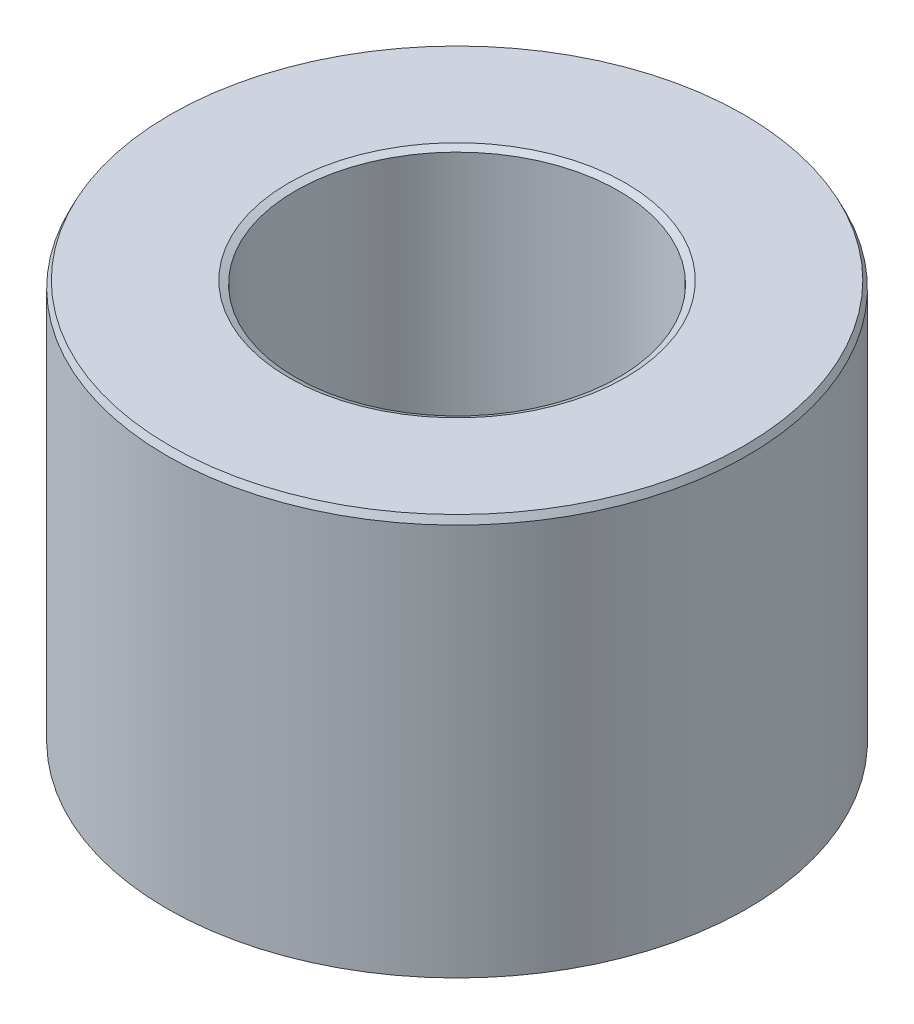
ISO-10303-21;
HEADER;
FILE_DESCRIPTION(('STEP AP214'),'2;1');
FILE_NAME('part.step','',(''),(''),'','','');
FILE_SCHEMA(('AUTOMOTIVE_DESIGN { 1 0 10303 214 1 1 1 1 }'));
ENDSEC;
DATA;
#1=APPLICATION_CONTEXT('core data for automotive mechanical design processes');
#2=APPLICATION_PROTOCOL_DEFINITION('international standard','automotive_design',2000,#1);
#3=PRODUCT_CONTEXT('',#1,'mechanical');
#4=PRODUCT('Part','Part','',(#3));
#5=PRODUCT_RELATED_PRODUCT_CATEGORY('part','',(#4));
#6=PRODUCT_DEFINITION_FORMATION('','',#4);
#7=PRODUCT_DEFINITION_CONTEXT('part definition',#1,'design');
#8=PRODUCT_DEFINITION('design','',#6,#7);
#9=PRODUCT_DEFINITION_SHAPE('','',#8);
#10=(LENGTH_UNIT() NAMED_UNIT(*) SI_UNIT(.MILLI.,.METRE.));
#11=(NAMED_UNIT(*) PLANE_ANGLE_UNIT() SI_UNIT($,.RADIAN.));
#12=(NAMED_UNIT(*) SI_UNIT($,.STERADIAN.) SOLID_ANGLE_UNIT());
#13=UNCERTAINTY_MEASURE_WITH_UNIT(LENGTH_MEASURE(1.E-05),#10,'distance_accuracy_value','');
#14=(GEOMETRIC_REPRESENTATION_CONTEXT(3) GLOBAL_UNCERTAINTY_ASSIGNED_CONTEXT((#13)) GLOBAL_UNIT_ASSIGNED_CONTEXT((#10,
#11,#12)) REPRESENTATION_CONTEXT('',''));
#15=CARTESIAN_POINT('',(0.,0.,0.));
#16=DIRECTION('',(0.,0.,1.));
#17=DIRECTION('',(1.,0.,0.));
#18=AXIS2_PLACEMENT_3D('',#15,#16,#17);
#19=CARTESIAN_POINT('',(0.,55.4586712411939,0.));
#20=DIRECTION('',(0.,-1.,0.));
#21=DIRECTION('',(0.,0.,-1.));
#22=AXIS2_PLACEMENT_3D('',#19,#20,#21);
#23=CYLINDRICAL_SURFACE('',#22,40.);
#24=CARTESIAN_POINT('',(0.,0.453539456905482,0.));
#25=DIRECTION('',(0.,1.,0.));
#26=DIRECTION('',(0.,0.,1.));
#27=AXIS2_PLACEMENT_3D('',#24,#25,#26);
#28=CIRCLE('',#27,40.);
#29=CARTESIAN_POINT('',(0.,0.453539456905482,40.));
#30=VERTEX_POINT('',#29);
#31=EDGE_CURVE('E10',#30,#30,#28,.T.);
#32=ORIENTED_EDGE('',*,*,#31,.T.);
#33=EDGE_LOOP('',(#32));
#34=FACE_BOUND('',#33,.T.);
#35=CARTESIAN_POINT('',(0.,54.5107957950163,0.));
#36=DIRECTION('',(0.,1.,0.));
#37=DIRECTION('',(0.,0.,1.));
#38=AXIS2_PLACEMENT_3D('',#35,#36,#37);
#39=CIRCLE('',#38,40.);
#40=CARTESIAN_POINT('',(0.,54.5107957950163,40.));
#41=VERTEX_POINT('',#40);
#42=EDGE_CURVE('E50',#41,#41,#39,.F.);
#43=ORIENTED_EDGE('',*,*,#42,.T.);
#44=EDGE_LOOP('',(#43));
#45=FACE_BOUND('',#44,.T.);
#46=ADVANCED_FACE('F39',(#34,#45),#23,.T.);
#47=CARTESIAN_POINT('',(0.,55.4586712411939,0.));
#48=DIRECTION('',(0.,1.,0.));
#49=DIRECTION('',(0.,0.,1.));
#50=AXIS2_PLACEMENT_3D('',#47,#48,#49);
#51=PLANE('',#50);
#52=CARTESIAN_POINT('',(0.,55.4586712411939,0.));
#53=DIRECTION('',(0.,1.,0.));
#54=DIRECTION('',(0.,0.,1.));
#55=AXIS2_PLACEMENT_3D('',#52,#53,#54);
#56=CIRCLE('',#55,23.2233448004281);
#57=CARTESIAN_POINT('',(0.,55.4586712411939,23.2233448004281));
#58=VERTEX_POINT('',#57);
#59=EDGE_CURVE('E58',#58,#58,#56,.F.);
#60=ORIENTED_EDGE('',*,*,#59,.T.);
#61=EDGE_LOOP('',(#60));
#62=FACE_BOUND('',#61,.T.);
#63=CARTESIAN_POINT('',(0.,55.4586712411939,0.));
#64=DIRECTION('',(0.,1.,0.));
#65=DIRECTION('',(0.,0.,1.));
#66=AXIS2_PLACEMENT_3D('',#63,#64,#65);
#67=CIRCLE('',#66,39.5464605430945);
#68=CARTESIAN_POINT('',(0.,55.4586712411939,39.5464605430945));
#69=VERTEX_POINT('',#68);
#70=EDGE_CURVE('E61',#69,#69,#67,.T.);
#71=ORIENTED_EDGE('',*,*,#70,.T.);
#72=EDGE_LOOP('',(#71));
#73=FACE_BOUND('',#72,.T.);
#74=ADVANCED_FACE('F88',(#62,#73),#51,.T.);
#75=CARTESIAN_POINT('',(0.,0.,0.));
#76=DIRECTION('',(0.,1.,0.));
#77=DIRECTION('',(0.,0.,1.));
#78=AXIS2_PLACEMENT_3D('',#75,#76,#77);
#79=PLANE('',#78);
#80=CARTESIAN_POINT('',(0.,0.,0.));
#81=DIRECTION('',(0.,1.,0.));
#82=DIRECTION('',(0.,0.,1.));
#83=AXIS2_PLACEMENT_3D('',#80,#81,#82);
#84=CIRCLE('',#83,22.7290088111561);
#85=CARTESIAN_POINT('',(0.,0.,22.7290088111561));
#86=VERTEX_POINT('',#85);
#87=EDGE_CURVE('E51',#86,#86,#84,.T.);
#88=ORIENTED_EDGE('',*,*,#87,.T.);
#89=EDGE_LOOP('',(#88));
#90=FACE_BOUND('',#89,.T.);
#91=CARTESIAN_POINT('',(0.,0.,0.));
#92=DIRECTION('',(0.,1.,0.));
#93=DIRECTION('',(0.,0.,1.));
#94=AXIS2_PLACEMENT_3D('',#91,#92,#93);
#95=CIRCLE('',#94,39.0521245538225);
#96=CARTESIAN_POINT('',(0.,0.,39.0521245538225));
#97=VERTEX_POINT('',#96);
#98=EDGE_CURVE('E54',#97,#97,#95,.F.);
#99=ORIENTED_EDGE('',*,*,#98,.T.);
#100=EDGE_LOOP('',(#99));
#101=FACE_BOUND('',#100,.T.);
#102=ADVANCED_FACE('F83',(#90,#101),#79,.F.);
#103=CARTESIAN_POINT('',(0.,55.4586712411939,0.));
#104=DIRECTION('',(0.,-1.,0.));
#105=DIRECTION('',(0.,0.,-1.));
#106=AXIS2_PLACEMENT_3D('',#103,#104,#105);
#107=CYLINDRICAL_SURFACE('',#106,22.2754693542506);
#108=CARTESIAN_POINT('',(0.,55.0051317842884,0.));
#109=DIRECTION('',(0.,1.,0.));
#110=DIRECTION('',(0.,0.,1.));
#111=AXIS2_PLACEMENT_3D('',#108,#109,#110);
#112=CIRCLE('',#111,22.2754693542506);
#113=CARTESIAN_POINT('',(0.,55.0051317842884,22.2754693542506));
#114=VERTEX_POINT('',#113);
#115=EDGE_CURVE('E67',#114,#114,#112,.T.);
#116=ORIENTED_EDGE('',*,*,#115,.T.);
#117=EDGE_LOOP('',(#116));
#118=FACE_BOUND('',#117,.T.);
#119=CARTESIAN_POINT('',(0.,0.947875446177575,0.));
#120=DIRECTION('',(0.,1.,0.));
#121=DIRECTION('',(0.,0.,1.));
#122=AXIS2_PLACEMENT_3D('',#119,#120,#121);
#123=CIRCLE('',#122,22.2754693542506);
#124=CARTESIAN_POINT('',(0.,0.947875446177575,22.2754693542506));
#125=VERTEX_POINT('',#124);
#126=EDGE_CURVE('E69',#125,#125,#123,.F.);
#127=ORIENTED_EDGE('',*,*,#126,.T.);
#128=EDGE_LOOP('',(#127));
#129=FACE_BOUND('',#128,.T.);
#130=ADVANCED_FACE('F71',(#118,#129),#107,.F.);
#131=CARTESIAN_POINT('',(0.,55.0051317842884,0.));
#132=DIRECTION('',(0.,1.,0.));
#133=DIRECTION('',(0.,0.,1.));
#134=AXIS2_PLACEMENT_3D('',#131,#132,#133);
#135=CONICAL_SURFACE('',#134,22.2754693542506,1.12451244308231);
#136=ORIENTED_EDGE('',*,*,#59,.F.);
#137=EDGE_LOOP('',(#136));
#138=FACE_BOUND('',#137,.T.);
#139=ORIENTED_EDGE('',*,*,#115,.F.);
#140=EDGE_LOOP('',(#139));
#141=FACE_BOUND('',#140,.T.);
#142=ADVANCED_FACE('F77',(#138,#141),#135,.F.);
#143=CARTESIAN_POINT('',(0.,0.,0.));
#144=DIRECTION('',(0.,-1.,0.));
#145=DIRECTION('',(0.,0.,-1.));
#146=AXIS2_PLACEMENT_3D('',#143,#144,#145);
#147=CONICAL_SURFACE('',#146,22.7290088111561,0.446283883712573);
#148=ORIENTED_EDGE('',*,*,#126,.F.);
#149=EDGE_LOOP('',(#148));
#150=FACE_BOUND('',#149,.T.);
#151=ORIENTED_EDGE('',*,*,#87,.F.);
#152=EDGE_LOOP('',(#151));
#153=FACE_BOUND('',#152,.T.);
#154=ADVANCED_FACE('F73',(#150,#153),#147,.F.);
#155=CARTESIAN_POINT('',(0.,0.453539456905482,0.));
#156=DIRECTION('',(0.,1.,0.));
#157=DIRECTION('',(0.,0.,1.));
#158=AXIS2_PLACEMENT_3D('',#155,#156,#157);
#159=CONICAL_SURFACE('',#158,40.,1.12451244308232);
#160=ORIENTED_EDGE('',*,*,#98,.F.);
#161=EDGE_LOOP('',(#160));
#162=FACE_BOUND('',#161,.T.);
#163=ORIENTED_EDGE('',*,*,#31,.F.);
#164=EDGE_LOOP('',(#163));
#165=FACE_BOUND('',#164,.T.);
#166=ADVANCED_FACE('F76',(#162,#165),#159,.T.);
#167=CARTESIAN_POINT('',(0.,55.4586712411939,0.));
#168=DIRECTION('',(0.,-1.,0.));
#169=DIRECTION('',(0.,0.,-1.));
#170=AXIS2_PLACEMENT_3D('',#167,#168,#169);
#171=CONICAL_SURFACE('',#170,39.5464605430945,0.446283883712579);
#172=ORIENTED_EDGE('',*,*,#42,.F.);
#173=EDGE_LOOP('',(#172));
#174=FACE_BOUND('',#173,.T.);
#175=ORIENTED_EDGE('',*,*,#70,.F.);
#176=EDGE_LOOP('',(#175));
#177=FACE_BOUND('',#176,.T.);
#178=ADVANCED_FACE('F45',(#174,#177),#171,.T.);
#179=CLOSED_SHELL('',(#46,#74,#102,#130,#142,#154,#166,#178));
#180=MANIFOLD_SOLID_BREP('B2',#179);
#181=ADVANCED_BREP_SHAPE_REPRESENTATION('',(#18,#180),#14);
#182=SHAPE_DEFINITION_REPRESENTATION(#9,#181);
ENDSEC;
END-ISO-10303-21;
